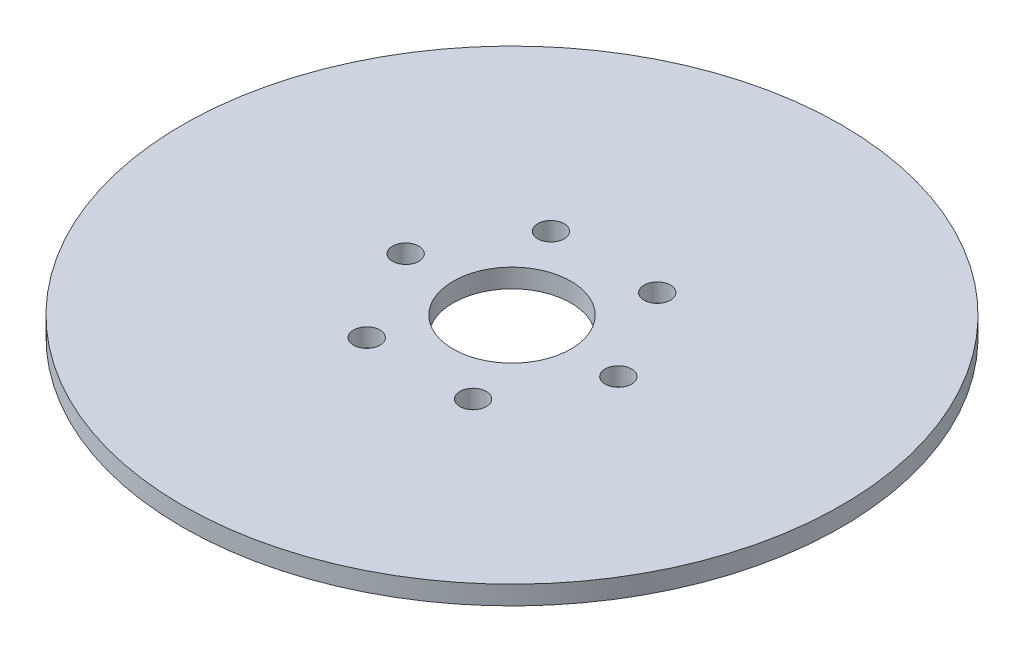
ISO-10303-21;
HEADER;
FILE_DESCRIPTION(('STEP AP214'),'2;1');
FILE_NAME('part.step','',(''),(''),'','','');
FILE_SCHEMA(('AUTOMOTIVE_DESIGN { 1 0 10303 214 1 1 1 1 }'));
ENDSEC;
DATA;
#1=APPLICATION_CONTEXT('core data for automotive mechanical design processes');
#2=APPLICATION_PROTOCOL_DEFINITION('international standard','automotive_design',2000,#1);
#3=PRODUCT_CONTEXT('',#1,'mechanical');
#4=PRODUCT('Part','Part','',(#3));
#5=PRODUCT_RELATED_PRODUCT_CATEGORY('part','',(#4));
#6=PRODUCT_DEFINITION_FORMATION('','',#4);
#7=PRODUCT_DEFINITION_CONTEXT('part definition',#1,'design');
#8=PRODUCT_DEFINITION('design','',#6,#7);
#9=PRODUCT_DEFINITION_SHAPE('','',#8);
#10=(LENGTH_UNIT() NAMED_UNIT(*) SI_UNIT(.MILLI.,.METRE.));
#11=(NAMED_UNIT(*) PLANE_ANGLE_UNIT() SI_UNIT($,.RADIAN.));
#12=(NAMED_UNIT(*) SI_UNIT($,.STERADIAN.) SOLID_ANGLE_UNIT());
#13=UNCERTAINTY_MEASURE_WITH_UNIT(LENGTH_MEASURE(1.E-05),#10,'distance_accuracy_value','');
#14=(GEOMETRIC_REPRESENTATION_CONTEXT(3) GLOBAL_UNCERTAINTY_ASSIGNED_CONTEXT((#13)) GLOBAL_UNIT_ASSIGNED_CONTEXT((#10,
#11,#12)) REPRESENTATION_CONTEXT('',''));
#15=CARTESIAN_POINT('',(0.,0.,0.));
#16=DIRECTION('',(0.,0.,1.));
#17=DIRECTION('',(1.,0.,0.));
#18=AXIS2_PLACEMENT_3D('',#15,#16,#17);
#19=CARTESIAN_POINT('',(0.,4.,0.));
#20=DIRECTION('',(0.,-1.,0.));
#21=DIRECTION('',(0.,0.,-1.));
#22=AXIS2_PLACEMENT_3D('',#19,#20,#21);
#23=CYLINDRICAL_SURFACE('',#22,70.);
#24=CARTESIAN_POINT('',(0.,4.,0.));
#25=DIRECTION('',(0.,1.,0.));
#26=DIRECTION('',(0.,0.,1.));
#27=AXIS2_PLACEMENT_3D('',#24,#25,#26);
#28=CIRCLE('',#27,70.);
#29=CARTESIAN_POINT('',(0.,4.,70.));
#30=VERTEX_POINT('',#29);
#31=EDGE_CURVE('E10',#30,#30,#28,.T.);
#32=ORIENTED_EDGE('',*,*,#31,.F.);
#33=EDGE_LOOP('',(#32));
#34=FACE_BOUND('',#33,.T.);
#35=CARTESIAN_POINT('',(0.,0.,0.));
#36=DIRECTION('',(0.,1.,0.));
#37=DIRECTION('',(0.,0.,1.));
#38=AXIS2_PLACEMENT_3D('',#35,#36,#37);
#39=CIRCLE('',#38,70.);
#40=CARTESIAN_POINT('',(0.,0.,70.));
#41=VERTEX_POINT('',#40);
#42=EDGE_CURVE('E37',#41,#41,#39,.T.);
#43=ORIENTED_EDGE('',*,*,#42,.T.);
#44=EDGE_LOOP('',(#43));
#45=FACE_BOUND('',#44,.T.);
#46=ADVANCED_FACE('F40',(#34,#45),#23,.T.);
#47=CARTESIAN_POINT('',(0.,4.,0.));
#48=DIRECTION('',(0.,1.,0.));
#49=DIRECTION('',(0.,0.,1.));
#50=AXIS2_PLACEMENT_3D('',#47,#48,#49);
#51=PLANE('',#50);
#52=CARTESIAN_POINT('',(-11.2940809921379,4.,-19.5619221031803));
#53=DIRECTION('',(0.,1.,0.));
#54=DIRECTION('',(-0.866025403784433,0.,0.50000000000001));
#55=AXIS2_PLACEMENT_3D('',#52,#53,#54);
#56=CIRCLE('',#55,2.80163480637507);
#57=CARTESIAN_POINT('',(-13.7203679065854,4.,-18.1611046999927));
#58=VERTEX_POINT('',#57);
#59=EDGE_CURVE('E70',#58,#58,#56,.T.);
#60=ORIENTED_EDGE('',*,*,#59,.F.);
#61=EDGE_LOOP('',(#60));
#62=FACE_BOUND('',#61,.T.);
#63=CARTESIAN_POINT('',(11.2940809921375,4.,-19.5619221031805));
#64=DIRECTION('',(0.,1.,0.));
#65=DIRECTION('',(-0.866025403784443,0.,-0.499999999999992));
#66=AXIS2_PLACEMENT_3D('',#63,#64,#65);
#67=CIRCLE('',#66,2.80163480637507);
#68=CARTESIAN_POINT('',(8.86779407769002,4.,-20.962739506368));
#69=VERTEX_POINT('',#68);
#70=EDGE_CURVE('E71',#69,#69,#67,.T.);
#71=ORIENTED_EDGE('',*,*,#70,.F.);
#72=EDGE_LOOP('',(#71));
#73=FACE_BOUND('',#72,.T.);
#74=CARTESIAN_POINT('',(22.5881619842754,4.,0.));
#75=DIRECTION('',(0.,1.,0.));
#76=DIRECTION('',(0.,0.,-1.));
#77=AXIS2_PLACEMENT_3D('',#74,#75,#76);
#78=CIRCLE('',#77,2.80163480637507);
#79=CARTESIAN_POINT('',(22.5881619842754,4.,-2.80163480637507));
#80=VERTEX_POINT('',#79);
#81=EDGE_CURVE('E78',#80,#80,#78,.T.);
#82=ORIENTED_EDGE('',*,*,#81,.F.);
#83=EDGE_LOOP('',(#82));
#84=FACE_BOUND('',#83,.T.);
#85=CARTESIAN_POINT('',(11.2940809921378,4.,19.5619221031804));
#86=DIRECTION('',(0.,1.,0.));
#87=DIRECTION('',(0.866025403784436,0.,-0.500000000000004));
#88=AXIS2_PLACEMENT_3D('',#85,#86,#87);
#89=CIRCLE('',#88,2.80163480637507);
#90=CARTESIAN_POINT('',(13.7203679065853,4.,18.1611046999928));
#91=VERTEX_POINT('',#90);
#92=EDGE_CURVE('E84',#91,#91,#89,.T.);
#93=ORIENTED_EDGE('',*,*,#92,.F.);
#94=EDGE_LOOP('',(#93));
#95=FACE_BOUND('',#94,.T.);
#96=CARTESIAN_POINT('',(-11.2940809921377,4.,19.5619221031805));
#97=DIRECTION('',(0.,1.,0.));
#98=DIRECTION('',(0.86602540378444,0.,0.499999999999998));
#99=AXIS2_PLACEMENT_3D('',#96,#97,#98);
#100=CIRCLE('',#99,2.80163480637507);
#101=CARTESIAN_POINT('',(-8.86779407769016,4.,20.962739506368));
#102=VERTEX_POINT('',#101);
#103=EDGE_CURVE('E61',#102,#102,#100,.T.);
#104=ORIENTED_EDGE('',*,*,#103,.F.);
#105=EDGE_LOOP('',(#104));
#106=FACE_BOUND('',#105,.T.);
#107=CARTESIAN_POINT('',(-22.5881619842754,4.,0.));
#108=DIRECTION('',(0.,1.,0.));
#109=DIRECTION('',(0.,0.,1.));
#110=AXIS2_PLACEMENT_3D('',#107,#108,#109);
#111=CIRCLE('',#110,2.80163480637507);
#112=CARTESIAN_POINT('',(-22.5881619842754,4.,2.80163480637507));
#113=VERTEX_POINT('',#112);
#114=EDGE_CURVE('E54',#113,#113,#111,.T.);
#115=ORIENTED_EDGE('',*,*,#114,.F.);
#116=EDGE_LOOP('',(#115));
#117=FACE_BOUND('',#116,.T.);
#118=CARTESIAN_POINT('',(0.,4.,0.));
#119=DIRECTION('',(0.,1.,0.));
#120=DIRECTION('',(0.,0.,1.));
#121=AXIS2_PLACEMENT_3D('',#118,#119,#120);
#122=CIRCLE('',#121,12.5);
#123=CARTESIAN_POINT('',(0.,4.,12.5));
#124=VERTEX_POINT('',#123);
#125=EDGE_CURVE('E50',#124,#124,#122,.T.);
#126=ORIENTED_EDGE('',*,*,#125,.F.);
#127=EDGE_LOOP('',(#126));
#128=FACE_BOUND('',#127,.T.);
#129=ORIENTED_EDGE('',*,*,#31,.T.);
#130=EDGE_LOOP('',(#129));
#131=FACE_BOUND('',#130,.T.);
#132=ADVANCED_FACE('F99',(#62,#73,#84,#95,#106,#117,#128,#131),#51,.T.);
#133=CARTESIAN_POINT('',(0.,0.,0.));
#134=DIRECTION('',(0.,1.,0.));
#135=DIRECTION('',(0.,0.,1.));
#136=AXIS2_PLACEMENT_3D('',#133,#134,#135);
#137=PLANE('',#136);
#138=CARTESIAN_POINT('',(0.,0.,0.));
#139=DIRECTION('',(0.,1.,0.));
#140=DIRECTION('',(0.,0.,1.));
#141=AXIS2_PLACEMENT_3D('',#138,#139,#140);
#142=CIRCLE('',#141,12.5);
#143=CARTESIAN_POINT('',(0.,0.,12.5));
#144=VERTEX_POINT('',#143);
#145=EDGE_CURVE('E47',#144,#144,#142,.T.);
#146=ORIENTED_EDGE('',*,*,#145,.T.);
#147=EDGE_LOOP('',(#146));
#148=FACE_BOUND('',#147,.T.);
#149=ORIENTED_EDGE('',*,*,#42,.F.);
#150=EDGE_LOOP('',(#149));
#151=FACE_BOUND('',#150,.T.);
#152=ADVANCED_FACE('F103',(#148,#151),#137,.F.);
#153=CARTESIAN_POINT('',(0.,4.,0.));
#154=DIRECTION('',(0.,-1.,0.));
#155=DIRECTION('',(0.,0.,-1.));
#156=AXIS2_PLACEMENT_3D('',#153,#154,#155);
#157=CYLINDRICAL_SURFACE('',#156,12.5);
#158=ORIENTED_EDGE('',*,*,#125,.T.);
#159=EDGE_LOOP('',(#158));
#160=FACE_BOUND('',#159,.T.);
#161=ORIENTED_EDGE('',*,*,#145,.F.);
#162=EDGE_LOOP('',(#161));
#163=FACE_BOUND('',#162,.T.);
#164=ADVANCED_FACE('F115',(#160,#163),#157,.F.);
#165=CARTESIAN_POINT('',(-22.5881619842754,0.0820420184952427,0.));
#166=DIRECTION('',(0.,1.,0.));
#167=DIRECTION('',(0.,0.,1.));
#168=AXIS2_PLACEMENT_3D('',#165,#166,#167);
#169=CYLINDRICAL_SURFACE('',#168,2.80163480637507);
#170=CARTESIAN_POINT('',(-22.5881619842754,0.0820420184952427,0.));
#171=DIRECTION('',(0.,1.,0.));
#172=DIRECTION('',(0.,0.,1.));
#173=AXIS2_PLACEMENT_3D('',#170,#171,#172);
#174=CIRCLE('',#173,2.80163480637507);
#175=CARTESIAN_POINT('',(-22.5881619842754,0.0820420184952427,2.80163480637507));
#176=VERTEX_POINT('',#175);
#177=EDGE_CURVE('E55',#176,#176,#174,.T.);
#178=ORIENTED_EDGE('',*,*,#177,.F.);
#179=EDGE_LOOP('',(#178));
#180=FACE_BOUND('',#179,.T.);
#181=ORIENTED_EDGE('',*,*,#114,.T.);
#182=EDGE_LOOP('',(#181));
#183=FACE_BOUND('',#182,.T.);
#184=ADVANCED_FACE('F113',(#180,#183),#169,.F.);
#185=CARTESIAN_POINT('',(-22.5881619842754,0.0820420184952427,0.));
#186=DIRECTION('',(0.,1.,0.));
#187=DIRECTION('',(0.,0.,1.));
#188=AXIS2_PLACEMENT_3D('',#185,#186,#187);
#189=PLANE('',#188);
#190=ORIENTED_EDGE('',*,*,#177,.T.);
#191=EDGE_LOOP('',(#190));
#192=FACE_BOUND('',#191,.T.);
#193=ADVANCED_FACE('F144',(#192),#189,.T.);
#194=CARTESIAN_POINT('',(-11.2940809921377,0.0820420184952427,19.5619221031805));
#195=DIRECTION('',(0.,1.,0.));
#196=DIRECTION('',(0.,0.,1.));
#197=AXIS2_PLACEMENT_3D('',#194,#195,#196);
#198=CYLINDRICAL_SURFACE('',#197,2.80163480637507);
#199=CARTESIAN_POINT('',(-11.2940809921377,0.0820420184952427,19.5619221031805));
#200=DIRECTION('',(0.,1.,0.));
#201=DIRECTION('',(0.86602540378444,0.,0.499999999999998));
#202=AXIS2_PLACEMENT_3D('',#199,#200,#201);
#203=CIRCLE('',#202,2.80163480637507);
#204=CARTESIAN_POINT('',(-8.86779407769016,0.0820420184952427,20.962739506368));
#205=VERTEX_POINT('',#204);
#206=EDGE_CURVE('E59',#205,#205,#203,.T.);
#207=ORIENTED_EDGE('',*,*,#206,.F.);
#208=EDGE_LOOP('',(#207));
#209=FACE_BOUND('',#208,.T.);
#210=ORIENTED_EDGE('',*,*,#103,.T.);
#211=EDGE_LOOP('',(#210));
#212=FACE_BOUND('',#211,.T.);
#213=ADVANCED_FACE('F153',(#209,#212),#198,.F.);
#214=CARTESIAN_POINT('',(-11.2940809921377,0.0820420184952427,19.5619221031805));
#215=DIRECTION('',(0.,1.,0.));
#216=DIRECTION('',(0.86602540378444,0.,0.499999999999998));
#217=AXIS2_PLACEMENT_3D('',#214,#215,#216);
#218=PLANE('',#217);
#219=ORIENTED_EDGE('',*,*,#206,.T.);
#220=EDGE_LOOP('',(#219));
#221=FACE_BOUND('',#220,.T.);
#222=ADVANCED_FACE('F96',(#221),#218,.T.);
#223=CARTESIAN_POINT('',(11.2940809921378,0.0820420184952427,19.5619221031804));
#224=DIRECTION('',(0.,1.,0.));
#225=DIRECTION('',(0.,0.,1.));
#226=AXIS2_PLACEMENT_3D('',#223,#224,#225);
#227=CYLINDRICAL_SURFACE('',#226,2.80163480637507);
#228=CARTESIAN_POINT('',(11.2940809921378,0.0820420184952427,19.5619221031804));
#229=DIRECTION('',(0.,1.,0.));
#230=DIRECTION('',(0.866025403784436,0.,-0.500000000000004));
#231=AXIS2_PLACEMENT_3D('',#228,#229,#230);
#232=CIRCLE('',#231,2.80163480637507);
#233=CARTESIAN_POINT('',(13.7203679065853,0.0820420184952427,18.1611046999928));
#234=VERTEX_POINT('',#233);
#235=EDGE_CURVE('E63',#234,#234,#232,.T.);
#236=ORIENTED_EDGE('',*,*,#235,.F.);
#237=EDGE_LOOP('',(#236));
#238=FACE_BOUND('',#237,.T.);
#239=ORIENTED_EDGE('',*,*,#92,.T.);
#240=EDGE_LOOP('',(#239));
#241=FACE_BOUND('',#240,.T.);
#242=ADVANCED_FACE('F91',(#238,#241),#227,.F.);
#243=CARTESIAN_POINT('',(11.2940809921378,0.0820420184952427,19.5619221031804));
#244=DIRECTION('',(0.,1.,0.));
#245=DIRECTION('',(0.866025403784436,0.,-0.500000000000004));
#246=AXIS2_PLACEMENT_3D('',#243,#244,#245);
#247=PLANE('',#246);
#248=ORIENTED_EDGE('',*,*,#235,.T.);
#249=EDGE_LOOP('',(#248));
#250=FACE_BOUND('',#249,.T.);
#251=ADVANCED_FACE('F93',(#250),#247,.T.);
#252=CARTESIAN_POINT('',(22.5881619842754,0.0820420184952427,0.));
#253=DIRECTION('',(0.,1.,0.));
#254=DIRECTION('',(0.,0.,1.));
#255=AXIS2_PLACEMENT_3D('',#252,#253,#254);
#256=CYLINDRICAL_SURFACE('',#255,2.80163480637507);
#257=CARTESIAN_POINT('',(22.5881619842754,0.0820420184952427,0.));
#258=DIRECTION('',(0.,1.,0.));
#259=DIRECTION('',(0.,0.,-1.));
#260=AXIS2_PLACEMENT_3D('',#257,#258,#259);
#261=CIRCLE('',#260,2.80163480637507);
#262=CARTESIAN_POINT('',(22.5881619842754,0.0820420184952427,-2.80163480637507));
#263=VERTEX_POINT('',#262);
#264=EDGE_CURVE('E85',#263,#263,#261,.T.);
#265=ORIENTED_EDGE('',*,*,#264,.F.);
#266=EDGE_LOOP('',(#265));
#267=FACE_BOUND('',#266,.T.);
#268=ORIENTED_EDGE('',*,*,#81,.T.);
#269=EDGE_LOOP('',(#268));
#270=FACE_BOUND('',#269,.T.);
#271=ADVANCED_FACE('F187',(#267,#270),#256,.F.);
#272=CARTESIAN_POINT('',(22.5881619842754,0.0820420184952427,0.));
#273=DIRECTION('',(0.,1.,0.));
#274=DIRECTION('',(0.,0.,-1.));
#275=AXIS2_PLACEMENT_3D('',#272,#273,#274);
#276=PLANE('',#275);
#277=ORIENTED_EDGE('',*,*,#264,.T.);
#278=EDGE_LOOP('',(#277));
#279=FACE_BOUND('',#278,.T.);
#280=ADVANCED_FACE('F198',(#279),#276,.T.);
#281=CARTESIAN_POINT('',(11.2940809921375,0.0820420184952427,-19.5619221031805));
#282=DIRECTION('',(0.,1.,0.));
#283=DIRECTION('',(0.,0.,1.));
#284=AXIS2_PLACEMENT_3D('',#281,#282,#283);
#285=CYLINDRICAL_SURFACE('',#284,2.80163480637507);
#286=CARTESIAN_POINT('',(11.2940809921375,0.0820420184952427,-19.5619221031805));
#287=DIRECTION('',(0.,1.,0.));
#288=DIRECTION('',(-0.866025403784443,0.,-0.499999999999992));
#289=AXIS2_PLACEMENT_3D('',#286,#287,#288);
#290=CIRCLE('',#289,2.80163480637507);
#291=CARTESIAN_POINT('',(8.86779407769002,0.0820420184952427,-20.962739506368));
#292=VERTEX_POINT('',#291);
#293=EDGE_CURVE('E76',#292,#292,#290,.T.);
#294=ORIENTED_EDGE('',*,*,#293,.F.);
#295=EDGE_LOOP('',(#294));
#296=FACE_BOUND('',#295,.T.);
#297=ORIENTED_EDGE('',*,*,#70,.T.);
#298=EDGE_LOOP('',(#297));
#299=FACE_BOUND('',#298,.T.);
#300=ADVANCED_FACE('F202',(#296,#299),#285,.F.);
#301=CARTESIAN_POINT('',(11.2940809921375,0.0820420184952427,-19.5619221031805));
#302=DIRECTION('',(0.,1.,0.));
#303=DIRECTION('',(-0.866025403784443,0.,-0.499999999999992));
#304=AXIS2_PLACEMENT_3D('',#301,#302,#303);
#305=PLANE('',#304);
#306=ORIENTED_EDGE('',*,*,#293,.T.);
#307=EDGE_LOOP('',(#306));
#308=FACE_BOUND('',#307,.T.);
#309=ADVANCED_FACE('F212',(#308),#305,.T.);
#310=CARTESIAN_POINT('',(-11.2940809921379,0.0820420184952427,-19.5619221031803));
#311=DIRECTION('',(0.,1.,0.));
#312=DIRECTION('',(0.,0.,1.));
#313=AXIS2_PLACEMENT_3D('',#310,#311,#312);
#314=CYLINDRICAL_SURFACE('',#313,2.80163480637507);
#315=CARTESIAN_POINT('',(-11.2940809921379,0.0820420184952427,-19.5619221031803));
#316=DIRECTION('',(0.,1.,0.));
#317=DIRECTION('',(-0.866025403784433,0.,0.50000000000001));
#318=AXIS2_PLACEMENT_3D('',#315,#316,#317);
#319=CIRCLE('',#318,2.80163480637507);
#320=CARTESIAN_POINT('',(-13.7203679065854,0.0820420184952427,-18.1611046999927));
#321=VERTEX_POINT('',#320);
#322=EDGE_CURVE('E69',#321,#321,#319,.T.);
#323=ORIENTED_EDGE('',*,*,#322,.F.);
#324=EDGE_LOOP('',(#323));
#325=FACE_BOUND('',#324,.T.);
#326=ORIENTED_EDGE('',*,*,#59,.T.);
#327=EDGE_LOOP('',(#326));
#328=FACE_BOUND('',#327,.T.);
#329=ADVANCED_FACE('F224',(#325,#328),#314,.F.);
#330=CARTESIAN_POINT('',(-11.2940809921379,0.0820420184952427,-19.5619221031803));
#331=DIRECTION('',(0.,1.,0.));
#332=DIRECTION('',(-0.866025403784433,0.,0.50000000000001));
#333=AXIS2_PLACEMENT_3D('',#330,#331,#332);
#334=PLANE('',#333);
#335=ORIENTED_EDGE('',*,*,#322,.T.);
#336=EDGE_LOOP('',(#335));
#337=FACE_BOUND('',#336,.T.);
#338=ADVANCED_FACE('F235',(#337),#334,.T.);
#339=CLOSED_SHELL('',(#46,#132,#152,#164,#184,#193,#213,#222,#242,#251,#271,#280,#300,#309,#329,#338));
#340=MANIFOLD_SOLID_BREP('B2',#339);
#341=ADVANCED_BREP_SHAPE_REPRESENTATION('',(#18,#340),#14);
#342=SHAPE_DEFINITION_REPRESENTATION(#9,#341);
ENDSEC;
END-ISO-10303-21;
